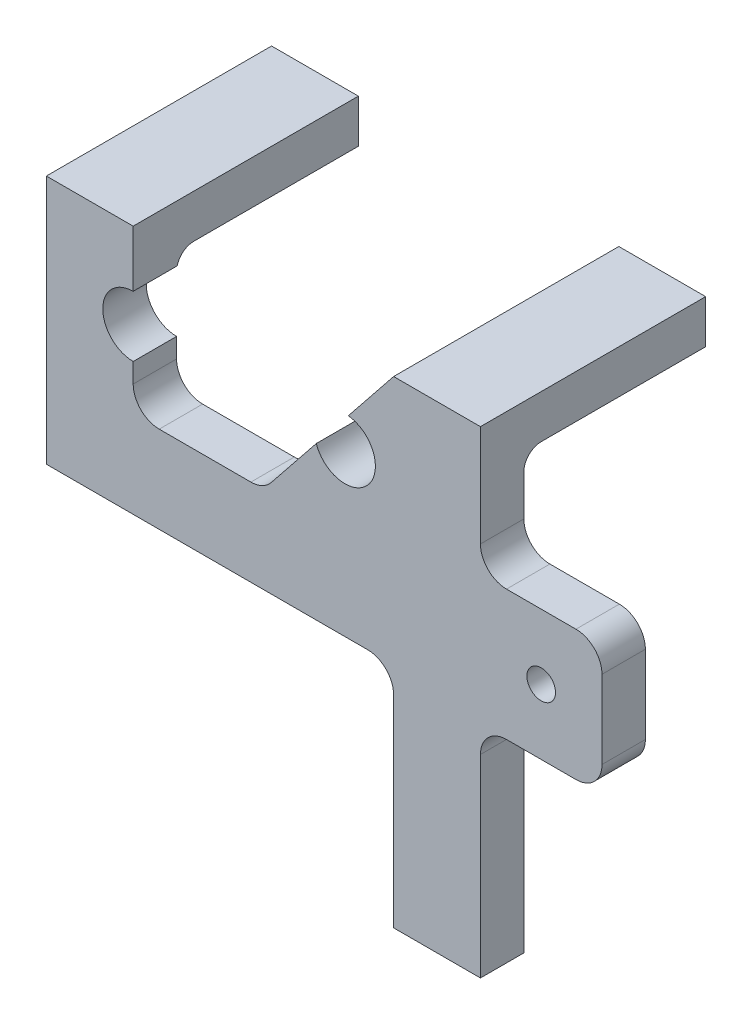
ISO-10303-21;
HEADER;
FILE_DESCRIPTION(('STEP AP214'),'2;1');
FILE_NAME('part.step','',(''),(''),'','','');
FILE_SCHEMA(('AUTOMOTIVE_DESIGN { 1 0 10303 214 1 1 1 1 }'));
ENDSEC;
DATA;
#1=APPLICATION_CONTEXT('core data for automotive mechanical design processes');
#2=APPLICATION_PROTOCOL_DEFINITION('international standard','automotive_design',2000,#1);
#3=PRODUCT_CONTEXT('',#1,'mechanical');
#4=PRODUCT('Part','Part','',(#3));
#5=PRODUCT_RELATED_PRODUCT_CATEGORY('part','',(#4));
#6=PRODUCT_DEFINITION_FORMATION('','',#4);
#7=PRODUCT_DEFINITION_CONTEXT('part definition',#1,'design');
#8=PRODUCT_DEFINITION('design','',#6,#7);
#9=PRODUCT_DEFINITION_SHAPE('','',#8);
#10=(LENGTH_UNIT() NAMED_UNIT(*) SI_UNIT(.MILLI.,.METRE.));
#11=(NAMED_UNIT(*) PLANE_ANGLE_UNIT() SI_UNIT($,.RADIAN.));
#12=(NAMED_UNIT(*) SI_UNIT($,.STERADIAN.) SOLID_ANGLE_UNIT());
#13=UNCERTAINTY_MEASURE_WITH_UNIT(LENGTH_MEASURE(1.E-05),#10,'distance_accuracy_value','');
#14=(GEOMETRIC_REPRESENTATION_CONTEXT(3) GLOBAL_UNCERTAINTY_ASSIGNED_CONTEXT((#13)) GLOBAL_UNIT_ASSIGNED_CONTEXT((#10,
#11,#12)) REPRESENTATION_CONTEXT('',''));
#15=CARTESIAN_POINT('',(0.,0.,0.));
#16=DIRECTION('',(0.,0.,1.));
#17=DIRECTION('',(1.,0.,0.));
#18=AXIS2_PLACEMENT_3D('',#15,#16,#17);
#19=CARTESIAN_POINT('',(0.,0.,6.35));
#20=DIRECTION('',(-1.,0.,0.));
#21=DIRECTION('',(0.,0.,1.));
#22=AXIS2_PLACEMENT_3D('',#19,#20,#21);
#23=PLANE('',#22);
#24=DIRECTION('',(0.,1.,0.));
#25=VECTOR('',#24,1.);
#26=CARTESIAN_POINT('',(0.,0.,6.35));
#27=LINE('',#26,#25);
#28=CARTESIAN_POINT('',(0.,54.98592,6.35));
#29=VERTEX_POINT('',#28);
#30=CARTESIAN_POINT('',(0.,69.85,6.35));
#31=VERTEX_POINT('',#30);
#32=EDGE_CURVE('E316',#29,#31,#27,.T.);
#33=ORIENTED_EDGE('',*,*,#32,.F.);
#34=DIRECTION('',(0.,0.,1.));
#35=VECTOR('',#34,1.);
#36=CARTESIAN_POINT('',(0.,54.98592,6.35));
#37=LINE('',#36,#35);
#38=CARTESIAN_POINT('',(0.,54.98592,0.));
#39=VERTEX_POINT('',#38);
#40=EDGE_CURVE('E576',#29,#39,#37,.F.);
#41=ORIENTED_EDGE('',*,*,#40,.T.);
#42=DIRECTION('',(0.,1.,0.));
#43=VECTOR('',#42,1.);
#44=CARTESIAN_POINT('',(0.,0.,0.));
#45=LINE('',#44,#43);
#46=CARTESIAN_POINT('',(0.,60.96,0.));
#47=VERTEX_POINT('',#46);
#48=EDGE_CURVE('E365',#39,#47,#45,.T.);
#49=ORIENTED_EDGE('',*,*,#48,.T.);
#50=CARTESIAN_POINT('',(0.,60.96,-2.54));
#51=DIRECTION('',(-1.,0.,0.));
#52=DIRECTION('',(0.,0.,1.));
#53=AXIS2_PLACEMENT_3D('',#50,#51,#52);
#54=CIRCLE('',#53,2.54);
#55=CARTESIAN_POINT('',(0.,63.5,-2.54));
#56=VERTEX_POINT('',#55);
#57=EDGE_CURVE('E756',#47,#56,#54,.T.);
#58=ORIENTED_EDGE('',*,*,#57,.T.);
#59=DIRECTION('',(0.,0.,1.));
#60=VECTOR('',#59,1.);
#61=CARTESIAN_POINT('',(0.,63.5,-26.5938));
#62=LINE('',#61,#60);
#63=CARTESIAN_POINT('',(0.,63.5,-26.5938));
#64=VERTEX_POINT('',#63);
#65=EDGE_CURVE('E307',#64,#56,#62,.T.);
#66=ORIENTED_EDGE('',*,*,#65,.F.);
#67=DIRECTION('',(0.,-1.,0.));
#68=VECTOR('',#67,1.);
#69=CARTESIAN_POINT('',(0.,69.85,-26.5938));
#70=LINE('',#69,#68);
#71=CARTESIAN_POINT('',(0.,69.85,-26.5938));
#72=VERTEX_POINT('',#71);
#73=EDGE_CURVE('E280',#72,#64,#70,.T.);
#74=ORIENTED_EDGE('',*,*,#73,.F.);
#75=DIRECTION('',(0.,0.,-1.));
#76=VECTOR('',#75,1.);
#77=CARTESIAN_POINT('',(0.,69.85,6.35));
#78=LINE('',#77,#76);
#79=EDGE_CURVE('E431',#31,#72,#78,.T.);
#80=ORIENTED_EDGE('',*,*,#79,.F.);
#81=EDGE_LOOP('',(#33,#41,#49,#58,#66,#74,#80));
#82=FACE_BOUND('',#81,.T.);
#83=ADVANCED_FACE('F39',(#82),#23,.F.);
#84=CARTESIAN_POINT('',(-19.812,57.15,0.));
#85=DIRECTION('',(0.,0.,1.));
#86=DIRECTION('',(1.,0.,0.));
#87=AXIS2_PLACEMENT_3D('',#84,#85,#86);
#88=PLANE('',#87);
#89=DIRECTION('',(0.,-1.,0.));
#90=VECTOR('',#89,1.);
#91=CARTESIAN_POINT('',(17.78,51.17592,0.));
#92=LINE('',#91,#90);
#93=CARTESIAN_POINT('',(17.78,47.36592,0.));
#94=VERTEX_POINT('',#93);
#95=CARTESIAN_POINT('',(17.78,35.93592,0.));
#96=VERTEX_POINT('',#95);
#97=EDGE_CURVE('E641',#94,#96,#92,.T.);
#98=ORIENTED_EDGE('',*,*,#97,.T.);
#99=CARTESIAN_POINT('',(13.97,35.93592,0.));
#100=DIRECTION('',(0.,0.,1.));
#101=DIRECTION('',(1.,0.,0.));
#102=AXIS2_PLACEMENT_3D('',#99,#100,#101);
#103=CIRCLE('',#102,3.81);
#104=CARTESIAN_POINT('',(13.97,32.12592,0.));
#105=VERTEX_POINT('',#104);
#106=EDGE_CURVE('E593',#96,#105,#103,.F.);
#107=ORIENTED_EDGE('',*,*,#106,.T.);
#108=DIRECTION('',(-1.,0.,0.));
#109=VECTOR('',#108,1.);
#110=CARTESIAN_POINT('',(17.78,32.12592,0.));
#111=LINE('',#110,#109);
#112=CARTESIAN_POINT('',(3.81,32.12592,0.));
#113=VERTEX_POINT('',#112);
#114=EDGE_CURVE('E640',#105,#113,#111,.T.);
#115=ORIENTED_EDGE('',*,*,#114,.T.);
#116=CARTESIAN_POINT('',(3.81,28.31592,0.));
#117=DIRECTION('',(0.,0.,1.));
#118=DIRECTION('',(1.,0.,0.));
#119=AXIS2_PLACEMENT_3D('',#116,#117,#118);
#120=CIRCLE('',#119,3.81);
#121=CARTESIAN_POINT('',(0.,28.31592,0.));
#122=VERTEX_POINT('',#121);
#123=EDGE_CURVE('E552',#113,#122,#120,.T.);
#124=ORIENTED_EDGE('',*,*,#123,.T.);
#125=CARTESIAN_POINT('',(0.,0.,0.));
#126=VERTEX_POINT('',#125);
#127=EDGE_CURVE('E366',#126,#122,#45,.T.);
#128=ORIENTED_EDGE('',*,*,#127,.F.);
#129=DIRECTION('',(1.,0.,0.));
#130=VECTOR('',#129,1.);
#131=CARTESIAN_POINT('',(-12.7,0.,0.));
#132=LINE('',#131,#130);
#133=CARTESIAN_POINT('',(-12.7,0.,0.));
#134=VERTEX_POINT('',#133);
#135=EDGE_CURVE('E311',#134,#126,#132,.T.);
#136=ORIENTED_EDGE('',*,*,#135,.F.);
#137=DIRECTION('',(0.,-1.,0.));
#138=VECTOR('',#137,1.);
#139=CARTESIAN_POINT('',(-12.7,33.3375,0.));
#140=LINE('',#139,#138);
#141=CARTESIAN_POINT('',(-12.7,29.5275,0.));
#142=VERTEX_POINT('',#141);
#143=EDGE_CURVE('E317',#142,#134,#140,.T.);
#144=ORIENTED_EDGE('',*,*,#143,.F.);
#145=CARTESIAN_POINT('',(-16.51,29.5275,0.));
#146=DIRECTION('',(0.,0.,1.));
#147=DIRECTION('',(1.,0.,0.));
#148=AXIS2_PLACEMENT_3D('',#145,#146,#147);
#149=CIRCLE('',#148,3.81);
#150=CARTESIAN_POINT('',(-16.51,33.3375,0.));
#151=VERTEX_POINT('',#150);
#152=EDGE_CURVE('E608',#142,#151,#149,.T.);
#153=ORIENTED_EDGE('',*,*,#152,.T.);
#154=DIRECTION('',(1.,0.,0.));
#155=VECTOR('',#154,1.);
#156=CARTESIAN_POINT('',(-63.5,33.3375,0.));
#157=LINE('',#156,#155);
#158=CARTESIAN_POINT('',(-63.5,33.3375,0.));
#159=VERTEX_POINT('',#158);
#160=EDGE_CURVE('E394',#159,#151,#157,.T.);
#161=ORIENTED_EDGE('',*,*,#160,.F.);
#162=DIRECTION('',(0.,-1.,0.));
#163=VECTOR('',#162,1.);
#164=CARTESIAN_POINT('',(-63.5,69.85,0.));
#165=LINE('',#164,#163);
#166=CARTESIAN_POINT('',(-63.5,60.96,0.));
#167=VERTEX_POINT('',#166);
#168=EDGE_CURVE('E391',#167,#159,#165,.T.);
#169=ORIENTED_EDGE('',*,*,#168,.F.);
#170=DIRECTION('',(-1.,0.,0.));
#171=VECTOR('',#170,1.);
#172=CARTESIAN_POINT('',(-50.8,60.96,0.));
#173=LINE('',#172,#171);
#174=CARTESIAN_POINT('',(-53.0895250599196,60.96,0.));
#175=VERTEX_POINT('',#174);
#176=EDGE_CURVE('E448',#167,#175,#173,.F.);
#177=ORIENTED_EDGE('',*,*,#176,.T.);
#178=CARTESIAN_POINT('',(-50.8,57.15,0.));
#179=DIRECTION('',(0.,0.,-1.));
#180=DIRECTION('',(1.,0.,0.));
#181=AXIS2_PLACEMENT_3D('',#178,#179,#180);
#182=CIRCLE('',#181,4.445);
#183=CARTESIAN_POINT('',(-50.8,52.705,0.));
#184=VERTEX_POINT('',#183);
#185=EDGE_CURVE('E387',#184,#175,#182,.T.);
#186=ORIENTED_EDGE('',*,*,#185,.F.);
#187=DIRECTION('',(0.,1.,0.));
#188=VECTOR('',#187,1.);
#189=CARTESIAN_POINT('',(-50.8,52.705,0.));
#190=LINE('',#189,#188);
#191=CARTESIAN_POINT('',(-50.8,49.8475,0.));
#192=VERTEX_POINT('',#191);
#193=EDGE_CURVE('E384',#192,#184,#190,.T.);
#194=ORIENTED_EDGE('',*,*,#193,.F.);
#195=CARTESIAN_POINT('',(-46.99,49.8475,0.));
#196=DIRECTION('',(0.,0.,1.));
#197=DIRECTION('',(1.,0.,0.));
#198=AXIS2_PLACEMENT_3D('',#195,#196,#197);
#199=CIRCLE('',#198,3.81);
#200=CARTESIAN_POINT('',(-46.99,46.0375,0.));
#201=VERTEX_POINT('',#200);
#202=EDGE_CURVE('E596',#192,#201,#199,.T.);
#203=ORIENTED_EDGE('',*,*,#202,.T.);
#204=DIRECTION('',(-1.,0.,0.));
#205=VECTOR('',#204,1.);
#206=CARTESIAN_POINT('',(-50.8,46.0375,0.));
#207=LINE('',#206,#205);
#208=CARTESIAN_POINT('',(-33.5811806689238,46.0375,0.));
#209=VERTEX_POINT('',#208);
#210=EDGE_CURVE('E380',#209,#201,#207,.T.);
#211=ORIENTED_EDGE('',*,*,#210,.F.);
#212=CARTESIAN_POINT('',(-33.5811806689238,49.8475,0.));
#213=DIRECTION('',(0.,0.,1.));
#214=DIRECTION('',(1.,0.,0.));
#215=AXIS2_PLACEMENT_3D('',#212,#213,#214);
#216=CIRCLE('',#215,3.81);
#217=CARTESIAN_POINT('',(-30.6060705049459,47.4674118688176,0.));
#218=VERTEX_POINT('',#217);
#219=EDGE_CURVE('E602',#209,#218,#216,.T.);
#220=ORIENTED_EDGE('',*,*,#219,.T.);
#221=DIRECTION('',(-0.624695047554424,-0.78086880944303,0.));
#222=VECTOR('',#221,1.);
#223=CARTESIAN_POINT('',(-24.0156991612731,55.7053760484086,0.));
#224=LINE('',#223,#222);
#225=CARTESIAN_POINT('',(-24.0156991612731,55.7053760484086,0.));
#226=VERTEX_POINT('',#225);
#227=EDGE_CURVE('E376',#226,#218,#224,.T.);
#228=ORIENTED_EDGE('',*,*,#227,.F.);
#229=CARTESIAN_POINT('',(-19.812,57.15,0.));
#230=DIRECTION('',(0.,0.,-1.));
#231=DIRECTION('',(1.,0.,0.));
#232=AXIS2_PLACEMENT_3D('',#229,#230,#231);
#233=CIRCLE('',#232,4.445);
#234=CARTESIAN_POINT('',(-19.3253740094586,61.5682824881768,0.));
#235=VERTEX_POINT('',#234);
#236=EDGE_CURVE('E373',#235,#226,#233,.T.);
#237=ORIENTED_EDGE('',*,*,#236,.F.);
#238=DIRECTION('',(-0.624695047554424,-0.78086880944303,0.));
#239=VECTOR('',#238,1.);
#240=CARTESIAN_POINT('',(-12.7,69.85,0.));
#241=LINE('',#240,#239);
#242=CARTESIAN_POINT('',(-15.24,66.675,0.));
#243=VERTEX_POINT('',#242);
#244=EDGE_CURVE('E370',#243,#235,#241,.T.);
#245=ORIENTED_EDGE('',*,*,#244,.F.);
#246=DIRECTION('',(0.,1.,0.));
#247=VECTOR('',#246,1.);
#248=CARTESIAN_POINT('',(-15.24,63.5,0.));
#249=LINE('',#248,#247);
#250=CARTESIAN_POINT('',(-15.24,60.96,0.));
#251=VERTEX_POINT('',#250);
#252=EDGE_CURVE('E441',#243,#251,#249,.F.);
#253=ORIENTED_EDGE('',*,*,#252,.T.);
#254=DIRECTION('',(-1.,0.,0.));
#255=VECTOR('',#254,1.);
#256=CARTESIAN_POINT('',(0.,60.96,0.));
#257=LINE('',#256,#255);
#258=EDGE_CURVE('E444',#251,#47,#257,.F.);
#259=ORIENTED_EDGE('',*,*,#258,.T.);
#260=ORIENTED_EDGE('',*,*,#48,.F.);
#261=CARTESIAN_POINT('',(3.81,54.98592,0.));
#262=DIRECTION('',(0.,0.,1.));
#263=DIRECTION('',(1.,0.,0.));
#264=AXIS2_PLACEMENT_3D('',#261,#262,#263);
#265=CIRCLE('',#264,3.81);
#266=CARTESIAN_POINT('',(3.81,51.17592,0.));
#267=VERTEX_POINT('',#266);
#268=EDGE_CURVE('E11',#39,#267,#265,.T.);
#269=ORIENTED_EDGE('',*,*,#268,.T.);
#270=DIRECTION('',(1.,0.,0.));
#271=VECTOR('',#270,1.);
#272=CARTESIAN_POINT('',(0.,51.17592,0.));
#273=LINE('',#272,#271);
#274=CARTESIAN_POINT('',(13.97,51.17592,0.));
#275=VERTEX_POINT('',#274);
#276=EDGE_CURVE('E635',#267,#275,#273,.T.);
#277=ORIENTED_EDGE('',*,*,#276,.T.);
#278=CARTESIAN_POINT('',(13.97,47.36592,0.));
#279=DIRECTION('',(0.,0.,1.));
#280=DIRECTION('',(1.,0.,0.));
#281=AXIS2_PLACEMENT_3D('',#278,#279,#280);
#282=CIRCLE('',#281,3.81);
#283=EDGE_CURVE('E62',#275,#94,#282,.F.);
#284=ORIENTED_EDGE('',*,*,#283,.T.);
#285=EDGE_LOOP('',(#98,#107,#115,#124,#128,#136,#144,#153,#161,#169,#177,#186,#194,#203,#211,
#220,#228,#237,#245,#253,#259,#260,#269,#277,#284));
#286=FACE_BOUND('',#285,.T.);
#287=CARTESIAN_POINT('',(8.89,41.65092,0.));
#288=DIRECTION('',(0.,0.,1.));
#289=DIRECTION('',(1.,0.,0.));
#290=AXIS2_PLACEMENT_3D('',#287,#288,#289);
#291=CIRCLE('',#290,2.0955);
#292=CARTESIAN_POINT('',(10.9855,41.65092,0.));
#293=VERTEX_POINT('',#292);
#294=EDGE_CURVE('E646',#293,#293,#291,.F.);
#295=ORIENTED_EDGE('',*,*,#294,.F.);
#296=EDGE_LOOP('',(#295));
#297=FACE_BOUND('',#296,.T.);
#298=ADVANCED_FACE('F523',(#286,#297),#88,.F.);
#299=CARTESIAN_POINT('',(-12.7,0.,6.35));
#300=DIRECTION('',(0.,1.,0.));
#301=DIRECTION('',(0.,0.,1.));
#302=AXIS2_PLACEMENT_3D('',#299,#300,#301);
#303=PLANE('',#302);
#304=ORIENTED_EDGE('',*,*,#135,.T.);
#305=DIRECTION('',(0.,0.,-1.));
#306=VECTOR('',#305,1.);
#307=CARTESIAN_POINT('',(0.,0.,6.35));
#308=LINE('',#307,#306);
#309=CARTESIAN_POINT('',(0.,0.,6.35));
#310=VERTEX_POINT('',#309);
#311=EDGE_CURVE('E434',#310,#126,#308,.T.);
#312=ORIENTED_EDGE('',*,*,#311,.F.);
#313=DIRECTION('',(1.,0.,0.));
#314=VECTOR('',#313,1.);
#315=CARTESIAN_POINT('',(-12.7,0.,6.35));
#316=LINE('',#315,#314);
#317=CARTESIAN_POINT('',(-12.7,0.,6.35));
#318=VERTEX_POINT('',#317);
#319=EDGE_CURVE('E312',#318,#310,#316,.T.);
#320=ORIENTED_EDGE('',*,*,#319,.F.);
#321=DIRECTION('',(0.,0.,-1.));
#322=VECTOR('',#321,1.);
#323=CARTESIAN_POINT('',(-12.7,0.,6.35));
#324=LINE('',#323,#322);
#325=EDGE_CURVE('E361',#318,#134,#324,.T.);
#326=ORIENTED_EDGE('',*,*,#325,.T.);
#327=EDGE_LOOP('',(#304,#312,#320,#326));
#328=FACE_BOUND('',#327,.T.);
#329=ADVANCED_FACE('F484',(#328),#303,.F.);
#330=ORIENTED_EDGE('',*,*,#127,.T.);
#331=DIRECTION('',(0.,0.,1.));
#332=VECTOR('',#331,1.);
#333=CARTESIAN_POINT('',(0.,28.31592,6.35));
#334=LINE('',#333,#332);
#335=CARTESIAN_POINT('',(0.,28.31592,6.35));
#336=VERTEX_POINT('',#335);
#337=EDGE_CURVE('E547',#122,#336,#334,.T.);
#338=ORIENTED_EDGE('',*,*,#337,.T.);
#339=EDGE_CURVE('E318',#310,#336,#27,.T.);
#340=ORIENTED_EDGE('',*,*,#339,.F.);
#341=ORIENTED_EDGE('',*,*,#311,.T.);
#342=EDGE_LOOP('',(#330,#338,#340,#341));
#343=FACE_BOUND('',#342,.T.);
#344=ADVANCED_FACE('F525',(#343),#23,.F.);
#345=CARTESIAN_POINT('',(0.,69.85,6.35));
#346=DIRECTION('',(0.,-1.,0.));
#347=DIRECTION('',(0.,0.,-1.));
#348=AXIS2_PLACEMENT_3D('',#345,#346,#347);
#349=PLANE('',#348);
#350=ORIENTED_EDGE('',*,*,#79,.T.);
#351=DIRECTION('',(1.,0.,0.));
#352=VECTOR('',#351,1.);
#353=CARTESIAN_POINT('',(0.,69.85,-26.5938));
#354=LINE('',#353,#352);
#355=CARTESIAN_POINT('',(-12.7,69.85,-26.5938));
#356=VERTEX_POINT('',#355);
#357=EDGE_CURVE('E295',#356,#72,#354,.T.);
#358=ORIENTED_EDGE('',*,*,#357,.F.);
#359=DIRECTION('',(0.,0.,1.));
#360=VECTOR('',#359,1.);
#361=CARTESIAN_POINT('',(-12.7,69.85,-26.5938));
#362=LINE('',#361,#360);
#363=CARTESIAN_POINT('',(-12.7,69.85,-2.54));
#364=VERTEX_POINT('',#363);
#365=EDGE_CURVE('E299',#356,#364,#362,.T.);
#366=ORIENTED_EDGE('',*,*,#365,.T.);
#367=DIRECTION('',(0.,0.,-1.));
#368=VECTOR('',#367,1.);
#369=CARTESIAN_POINT('',(-12.7,69.85,6.35));
#370=LINE('',#369,#368);
#371=CARTESIAN_POINT('',(-12.7,69.85,6.35));
#372=VERTEX_POINT('',#371);
#373=EDGE_CURVE('E428',#372,#364,#370,.T.);
#374=ORIENTED_EDGE('',*,*,#373,.F.);
#375=DIRECTION('',(-1.,0.,0.));
#376=VECTOR('',#375,1.);
#377=CARTESIAN_POINT('',(0.,69.85,6.35));
#378=LINE('',#377,#376);
#379=EDGE_CURVE('E322',#31,#372,#378,.T.);
#380=ORIENTED_EDGE('',*,*,#379,.F.);
#381=EDGE_LOOP('',(#350,#358,#366,#374,#380));
#382=FACE_BOUND('',#381,.T.);
#383=ADVANCED_FACE('F535',(#382),#349,.F.);
#384=CARTESIAN_POINT('',(-12.7,69.85,6.35));
#385=DIRECTION('',(0.78086880944303,-0.624695047554424,0.));
#386=DIRECTION('',(0.624695047554424,0.78086880944303,0.));
#387=AXIS2_PLACEMENT_3D('',#384,#385,#386);
#388=PLANE('',#387);
#389=ORIENTED_EDGE('',*,*,#373,.T.);
#390=CARTESIAN_POINT('',(-15.24,66.675,-2.54));
#391=DIRECTION('',(0.78086880944303,-0.624695047554424,0.));
#392=DIRECTION('',(-0.624695047554424,-0.78086880944303,0.));
#393=AXIS2_PLACEMENT_3D('',#390,#391,#392);
#394=ELLIPSE('',#393,4.06598389076986,2.54);
#395=EDGE_CURVE('E676',#364,#243,#394,.T.);
#396=ORIENTED_EDGE('',*,*,#395,.T.);
#397=ORIENTED_EDGE('',*,*,#244,.T.);
#398=DIRECTION('',(0.,0.,-1.));
#399=VECTOR('',#398,1.);
#400=CARTESIAN_POINT('',(-19.3253740094586,61.5682824881768,6.35));
#401=LINE('',#400,#399);
#402=CARTESIAN_POINT('',(-19.3253740094586,61.5682824881768,6.35));
#403=VERTEX_POINT('',#402);
#404=EDGE_CURVE('E424',#403,#235,#401,.T.);
#405=ORIENTED_EDGE('',*,*,#404,.F.);
#406=DIRECTION('',(-0.624695047554424,-0.78086880944303,0.));
#407=VECTOR('',#406,1.);
#408=CARTESIAN_POINT('',(-12.7,69.85,6.35));
#409=LINE('',#408,#407);
#410=EDGE_CURVE('E325',#372,#403,#409,.T.);
#411=ORIENTED_EDGE('',*,*,#410,.F.);
#412=EDGE_LOOP('',(#389,#396,#397,#405,#411));
#413=FACE_BOUND('',#412,.T.);
#414=ADVANCED_FACE('F541',(#413),#388,.F.);
#415=CARTESIAN_POINT('',(-19.812,57.15,6.35));
#416=DIRECTION('',(0.,0.,-1.));
#417=DIRECTION('',(-1.,0.,0.));
#418=AXIS2_PLACEMENT_3D('',#415,#416,#417);
#419=CYLINDRICAL_SURFACE('',#418,4.445);
#420=ORIENTED_EDGE('',*,*,#236,.T.);
#421=DIRECTION('',(0.,0.,-1.));
#422=VECTOR('',#421,1.);
#423=CARTESIAN_POINT('',(-24.0156991612731,55.7053760484086,6.35));
#424=LINE('',#423,#422);
#425=CARTESIAN_POINT('',(-24.0156991612731,55.7053760484086,6.35));
#426=VERTEX_POINT('',#425);
#427=EDGE_CURVE('E420',#426,#226,#424,.T.);
#428=ORIENTED_EDGE('',*,*,#427,.F.);
#429=CARTESIAN_POINT('',(-19.812,57.15,6.35));
#430=DIRECTION('',(0.,0.,-1.));
#431=DIRECTION('',(1.,0.,0.));
#432=AXIS2_PLACEMENT_3D('',#429,#430,#431);
#433=CIRCLE('',#432,4.445);
#434=EDGE_CURVE('E328',#403,#426,#433,.T.);
#435=ORIENTED_EDGE('',*,*,#434,.F.);
#436=ORIENTED_EDGE('',*,*,#404,.T.);
#437=EDGE_LOOP('',(#420,#428,#435,#436));
#438=FACE_BOUND('',#437,.T.);
#439=ADVANCED_FACE('F738',(#438),#419,.F.);
#440=CARTESIAN_POINT('',(-24.0156991612731,55.7053760484086,6.35));
#441=DIRECTION('',(0.78086880944303,-0.624695047554424,0.));
#442=DIRECTION('',(0.624695047554424,0.78086880944303,0.));
#443=AXIS2_PLACEMENT_3D('',#440,#441,#442);
#444=PLANE('',#443);
#445=ORIENTED_EDGE('',*,*,#227,.T.);
#446=DIRECTION('',(0.,0.,-1.));
#447=VECTOR('',#446,1.);
#448=CARTESIAN_POINT('',(-30.6060705049459,47.4674118688176,6.35));
#449=LINE('',#448,#447);
#450=CARTESIAN_POINT('',(-30.6060705049459,47.4674118688176,6.35));
#451=VERTEX_POINT('',#450);
#452=EDGE_CURVE('E688',#218,#451,#449,.F.);
#453=ORIENTED_EDGE('',*,*,#452,.T.);
#454=DIRECTION('',(-0.624695047554424,-0.78086880944303,0.));
#455=VECTOR('',#454,1.);
#456=CARTESIAN_POINT('',(-24.0156991612731,55.7053760484086,6.35));
#457=LINE('',#456,#455);
#458=EDGE_CURVE('E331',#426,#451,#457,.T.);
#459=ORIENTED_EDGE('',*,*,#458,.F.);
#460=ORIENTED_EDGE('',*,*,#427,.T.);
#461=EDGE_LOOP('',(#445,#453,#459,#460));
#462=FACE_BOUND('',#461,.T.);
#463=ADVANCED_FACE('F734',(#462),#444,.F.);
#464=CARTESIAN_POINT('',(-50.8,46.0375,6.35));
#465=DIRECTION('',(0.,-1.,0.));
#466=DIRECTION('',(0.,0.,-1.));
#467=AXIS2_PLACEMENT_3D('',#464,#465,#466);
#468=PLANE('',#467);
#469=ORIENTED_EDGE('',*,*,#210,.T.);
#470=DIRECTION('',(0.,0.,-1.));
#471=VECTOR('',#470,1.);
#472=CARTESIAN_POINT('',(-46.99,46.0375,6.35));
#473=LINE('',#472,#471);
#474=CARTESIAN_POINT('',(-46.99,46.0375,6.35));
#475=VERTEX_POINT('',#474);
#476=EDGE_CURVE('E685',#201,#475,#473,.F.);
#477=ORIENTED_EDGE('',*,*,#476,.T.);
#478=DIRECTION('',(-1.,0.,0.));
#479=VECTOR('',#478,1.);
#480=CARTESIAN_POINT('',(-50.8,46.0375,6.35));
#481=LINE('',#480,#479);
#482=CARTESIAN_POINT('',(-33.5811806689238,46.0375,6.35));
#483=VERTEX_POINT('',#482);
#484=EDGE_CURVE('E335',#483,#475,#481,.T.);
#485=ORIENTED_EDGE('',*,*,#484,.F.);
#486=DIRECTION('',(0.,0.,-1.));
#487=VECTOR('',#486,1.);
#488=CARTESIAN_POINT('',(-33.5811806689238,46.0375,0.));
#489=LINE('',#488,#487);
#490=EDGE_CURVE('E681',#483,#209,#489,.T.);
#491=ORIENTED_EDGE('',*,*,#490,.T.);
#492=EDGE_LOOP('',(#469,#477,#485,#491));
#493=FACE_BOUND('',#492,.T.);
#494=ADVANCED_FACE('F726',(#493),#468,.F.);
#495=CARTESIAN_POINT('',(-50.8,52.705,6.35));
#496=DIRECTION('',(-1.,0.,0.));
#497=DIRECTION('',(0.,0.,1.));
#498=AXIS2_PLACEMENT_3D('',#495,#496,#497);
#499=PLANE('',#498);
#500=DIRECTION('',(0.,1.,0.));
#501=VECTOR('',#500,1.);
#502=CARTESIAN_POINT('',(-50.8,52.705,6.35));
#503=LINE('',#502,#501);
#504=CARTESIAN_POINT('',(-50.8,49.8475,6.35));
#505=VERTEX_POINT('',#504);
#506=CARTESIAN_POINT('',(-50.8,52.705,6.35));
#507=VERTEX_POINT('',#506);
#508=EDGE_CURVE('E339',#505,#507,#503,.T.);
#509=ORIENTED_EDGE('',*,*,#508,.F.);
#510=DIRECTION('',(0.,0.,-1.));
#511=VECTOR('',#510,1.);
#512=CARTESIAN_POINT('',(-50.8,49.8475,0.));
#513=LINE('',#512,#511);
#514=EDGE_CURVE('E677',#505,#192,#513,.T.);
#515=ORIENTED_EDGE('',*,*,#514,.T.);
#516=ORIENTED_EDGE('',*,*,#193,.T.);
#517=DIRECTION('',(0.,0.,-1.));
#518=VECTOR('',#517,1.);
#519=CARTESIAN_POINT('',(-50.8,52.705,6.35));
#520=LINE('',#519,#518);
#521=EDGE_CURVE('E416',#507,#184,#520,.T.);
#522=ORIENTED_EDGE('',*,*,#521,.F.);
#523=EDGE_LOOP('',(#509,#515,#516,#522));
#524=FACE_BOUND('',#523,.T.);
#525=ADVANCED_FACE('F720',(#524),#499,.F.);
#526=CARTESIAN_POINT('',(-50.8,57.15,6.35));
#527=DIRECTION('',(0.,0.,-1.));
#528=DIRECTION('',(-1.,0.,0.));
#529=AXIS2_PLACEMENT_3D('',#526,#527,#528);
#530=CYLINDRICAL_SURFACE('',#529,4.445);
#531=ORIENTED_EDGE('',*,*,#185,.T.);
#532=CARTESIAN_POINT('',(-53.0895250599196,60.96,0.));
#533=CARTESIAN_POINT('',(-52.9965233707407,61.0158963220729,-2.2966462133705E-05));
#534=CARTESIAN_POINT('',(-52.9014950034798,61.0683572208066,-0.00184531158244023));
#535=CARTESIAN_POINT('',(-52.7079419780591,61.1661569484623,-0.00790017531887777));
#536=CARTESIAN_POINT('',(-52.6094182530155,61.2114976609003,-0.0121320551615551));
#537=CARTESIAN_POINT('',(-52.4113138951135,61.2940306993063,-0.0217251117489694));
#538=CARTESIAN_POINT('',(-52.3117904479379,61.3313635163102,-0.0270628932624042));
#539=CARTESIAN_POINT('',(-52.1103352155206,61.3988029553448,-0.0379565195917531));
#540=CARTESIAN_POINT('',(-52.0084034872875,61.4289097482418,-0.0435123592478581));
#541=CARTESIAN_POINT('',(-51.8161555049799,61.478275158496,-0.0533281162844189));
#542=CARTESIAN_POINT('',(-51.7260744776288,61.4984397030437,-0.0576623741206688));
#543=CARTESIAN_POINT('',(-51.5448024525882,61.5331277555642,-0.0654416428762133));
#544=CARTESIAN_POINT('',(-51.4536115851522,61.5476519190457,-0.0688867571135647));
#545=CARTESIAN_POINT('',(-51.2689072823645,61.5711945891794,-0.07459955494731));
#546=CARTESIAN_POINT('',(-51.1753807090689,61.5801153674318,-0.0768462406642677));
#547=CARTESIAN_POINT('',(-50.9879039682569,61.592021375148,-0.0798872040256234));
#548=CARTESIAN_POINT('',(-50.8939537001074,61.595005111022,-0.0806811161897842));
#549=CARTESIAN_POINT('',(-50.8,61.595,-0.0806555751582846));
#550=B_SPLINE_CURVE_WITH_KNOTS('',3,(#532,#533,#534,#535,#536,#537,#538,#539,#540,#541,#542,
#543,#544,#545,#546,#547,#548,#549),.UNSPECIFIED.,.F.,.F.,(4,2,2,2,2,2,2,2,4),(0.,
0.325388479572874,0.650690738013328,0.969708757315323,1.288719232387,1.56577914446501,
1.84280684780547,2.12454100910697,2.40634603769486),.UNSPECIFIED.);
#551=CARTESIAN_POINT('',(-50.8,61.595,-0.0806555751582845));
#552=VERTEX_POINT('',#551);
#553=EDGE_CURVE('E462',#175,#552,#550,.T.);
#554=ORIENTED_EDGE('',*,*,#553,.T.);
#555=DIRECTION('',(0.,0.,-1.));
#556=VECTOR('',#555,1.);
#557=CARTESIAN_POINT('',(-50.8,61.595,6.35));
#558=LINE('',#557,#556);
#559=CARTESIAN_POINT('',(-50.8,61.595,6.35));
#560=VERTEX_POINT('',#559);
#561=EDGE_CURVE('E413',#560,#552,#558,.T.);
#562=ORIENTED_EDGE('',*,*,#561,.F.);
#563=CARTESIAN_POINT('',(-50.8,57.15,6.35));
#564=DIRECTION('',(0.,0.,-1.));
#565=DIRECTION('',(1.,0.,0.));
#566=AXIS2_PLACEMENT_3D('',#563,#564,#565);
#567=CIRCLE('',#566,4.445);
#568=EDGE_CURVE('E342',#507,#560,#567,.T.);
#569=ORIENTED_EDGE('',*,*,#568,.F.);
#570=ORIENTED_EDGE('',*,*,#521,.T.);
#571=EDGE_LOOP('',(#531,#554,#562,#569,#570));
#572=FACE_BOUND('',#571,.T.);
#573=ADVANCED_FACE('F473',(#572),#530,.F.);
#574=CARTESIAN_POINT('',(-50.8,69.85,6.35));
#575=DIRECTION('',(-1.,0.,0.));
#576=DIRECTION('',(0.,0.,1.));
#577=AXIS2_PLACEMENT_3D('',#574,#575,#576);
#578=PLANE('',#577);
#579=DIRECTION('',(0.,0.,-1.));
#580=VECTOR('',#579,1.);
#581=CARTESIAN_POINT('',(-50.8,69.85,6.35));
#582=LINE('',#581,#580);
#583=CARTESIAN_POINT('',(-50.8,69.85,6.35));
#584=VERTEX_POINT('',#583);
#585=CARTESIAN_POINT('',(-50.8,69.85,-26.5938));
#586=VERTEX_POINT('',#585);
#587=EDGE_CURVE('E410',#584,#586,#582,.T.);
#588=ORIENTED_EDGE('',*,*,#587,.F.);
#589=DIRECTION('',(0.,1.,0.));
#590=VECTOR('',#589,1.);
#591=CARTESIAN_POINT('',(-50.8,69.85,6.35));
#592=LINE('',#591,#590);
#593=EDGE_CURVE('E345',#560,#584,#592,.T.);
#594=ORIENTED_EDGE('',*,*,#593,.F.);
#595=ORIENTED_EDGE('',*,*,#561,.T.);
#596=CARTESIAN_POINT('',(-50.8,60.96,-2.54));
#597=DIRECTION('',(-1.,0.,0.));
#598=DIRECTION('',(0.,0.,1.));
#599=AXIS2_PLACEMENT_3D('',#596,#597,#598);
#600=CIRCLE('',#599,2.54);
#601=CARTESIAN_POINT('',(-50.8,63.5,-2.54));
#602=VERTEX_POINT('',#601);
#603=EDGE_CURVE('E278',#552,#602,#600,.T.);
#604=ORIENTED_EDGE('',*,*,#603,.T.);
#605=DIRECTION('',(0.,0.,1.));
#606=VECTOR('',#605,1.);
#607=CARTESIAN_POINT('',(-50.8,63.5,-26.5938));
#608=LINE('',#607,#606);
#609=CARTESIAN_POINT('',(-50.8,63.5,-26.5938));
#610=VERTEX_POINT('',#609);
#611=EDGE_CURVE('E255',#610,#602,#608,.T.);
#612=ORIENTED_EDGE('',*,*,#611,.F.);
#613=DIRECTION('',(0.,-1.,0.));
#614=VECTOR('',#613,1.);
#615=CARTESIAN_POINT('',(-50.8,69.85,-26.5938));
#616=LINE('',#615,#614);
#617=EDGE_CURVE('E264',#586,#610,#616,.T.);
#618=ORIENTED_EDGE('',*,*,#617,.F.);
#619=EDGE_LOOP('',(#588,#594,#595,#604,#612,#618));
#620=FACE_BOUND('',#619,.T.);
#621=ADVANCED_FACE('F276',(#620),#578,.F.);
#622=CARTESIAN_POINT('',(-50.8,69.85,6.35));
#623=DIRECTION('',(0.,-1.,0.));
#624=DIRECTION('',(1.,0.,0.));
#625=AXIS2_PLACEMENT_3D('',#622,#623,#624);
#626=PLANE('',#625);
#627=ORIENTED_EDGE('',*,*,#587,.T.);
#628=DIRECTION('',(1.,0.,0.));
#629=VECTOR('',#628,1.);
#630=CARTESIAN_POINT('',(-50.8,69.85,-26.5938));
#631=LINE('',#630,#629);
#632=CARTESIAN_POINT('',(-63.5,69.85,-26.5938));
#633=VERTEX_POINT('',#632);
#634=EDGE_CURVE('E270',#633,#586,#631,.T.);
#635=ORIENTED_EDGE('',*,*,#634,.F.);
#636=DIRECTION('',(0.,0.,-1.));
#637=VECTOR('',#636,1.);
#638=CARTESIAN_POINT('',(-63.5,69.85,6.35));
#639=LINE('',#638,#637);
#640=CARTESIAN_POINT('',(-63.5,69.85,6.35));
#641=VERTEX_POINT('',#640);
#642=EDGE_CURVE('E407',#641,#633,#639,.T.);
#643=ORIENTED_EDGE('',*,*,#642,.F.);
#644=DIRECTION('',(-1.,0.,0.));
#645=VECTOR('',#644,1.);
#646=CARTESIAN_POINT('',(-50.8,69.85,6.35));
#647=LINE('',#646,#645);
#648=EDGE_CURVE('E348',#584,#641,#647,.T.);
#649=ORIENTED_EDGE('',*,*,#648,.F.);
#650=EDGE_LOOP('',(#627,#635,#643,#649));
#651=FACE_BOUND('',#650,.T.);
#652=ADVANCED_FACE('F780',(#651),#626,.F.);
#653=CARTESIAN_POINT('',(-63.5,69.85,6.35));
#654=DIRECTION('',(1.,0.,0.));
#655=DIRECTION('',(0.,0.,-1.));
#656=AXIS2_PLACEMENT_3D('',#653,#654,#655);
#657=PLANE('',#656);
#658=ORIENTED_EDGE('',*,*,#642,.T.);
#659=DIRECTION('',(0.,1.,0.));
#660=VECTOR('',#659,1.);
#661=CARTESIAN_POINT('',(-63.5,69.85,-26.5938));
#662=LINE('',#661,#660);
#663=CARTESIAN_POINT('',(-63.5,63.5,-26.5938));
#664=VERTEX_POINT('',#663);
#665=EDGE_CURVE('E263',#664,#633,#662,.T.);
#666=ORIENTED_EDGE('',*,*,#665,.F.);
#667=DIRECTION('',(0.,0.,1.));
#668=VECTOR('',#667,1.);
#669=CARTESIAN_POINT('',(-63.5,63.5,-26.5938));
#670=LINE('',#669,#668);
#671=CARTESIAN_POINT('',(-63.5,63.5,-2.54));
#672=VERTEX_POINT('',#671);
#673=EDGE_CURVE('E258',#664,#672,#670,.T.);
#674=ORIENTED_EDGE('',*,*,#673,.T.);
#675=CARTESIAN_POINT('',(-63.5,60.96,-2.54));
#676=DIRECTION('',(1.,0.,0.));
#677=DIRECTION('',(0.,0.,-1.));
#678=AXIS2_PLACEMENT_3D('',#675,#676,#677);
#679=CIRCLE('',#678,2.54);
#680=EDGE_CURVE('E459',#672,#167,#679,.T.);
#681=ORIENTED_EDGE('',*,*,#680,.T.);
#682=ORIENTED_EDGE('',*,*,#168,.T.);
#683=DIRECTION('',(0.,0.,-1.));
#684=VECTOR('',#683,1.);
#685=CARTESIAN_POINT('',(-63.5,33.3375,6.35));
#686=LINE('',#685,#684);
#687=CARTESIAN_POINT('',(-63.5,33.3375,6.35));
#688=VERTEX_POINT('',#687);
#689=EDGE_CURVE('E403',#688,#159,#686,.T.);
#690=ORIENTED_EDGE('',*,*,#689,.F.);
#691=DIRECTION('',(0.,-1.,0.));
#692=VECTOR('',#691,1.);
#693=CARTESIAN_POINT('',(-63.5,69.85,6.35));
#694=LINE('',#693,#692);
#695=EDGE_CURVE('E351',#641,#688,#694,.T.);
#696=ORIENTED_EDGE('',*,*,#695,.F.);
#697=EDGE_LOOP('',(#658,#666,#674,#681,#682,#690,#696));
#698=FACE_BOUND('',#697,.T.);
#699=ADVANCED_FACE('F784',(#698),#657,.F.);
#700=CARTESIAN_POINT('',(-63.5,33.3375,6.35));
#701=DIRECTION('',(0.,1.,0.));
#702=DIRECTION('',(0.,0.,1.));
#703=AXIS2_PLACEMENT_3D('',#700,#701,#702);
#704=PLANE('',#703);
#705=ORIENTED_EDGE('',*,*,#160,.T.);
#706=DIRECTION('',(0.,0.,-1.));
#707=VECTOR('',#706,1.);
#708=CARTESIAN_POINT('',(-16.51,33.3375,6.35));
#709=LINE('',#708,#707);
#710=CARTESIAN_POINT('',(-16.51,33.3375,6.35));
#711=VERTEX_POINT('',#710);
#712=EDGE_CURVE('E556',#151,#711,#709,.F.);
#713=ORIENTED_EDGE('',*,*,#712,.T.);
#714=DIRECTION('',(1.,0.,0.));
#715=VECTOR('',#714,1.);
#716=CARTESIAN_POINT('',(-63.5,33.3375,6.35));
#717=LINE('',#716,#715);
#718=EDGE_CURVE('E354',#688,#711,#717,.T.);
#719=ORIENTED_EDGE('',*,*,#718,.F.);
#720=ORIENTED_EDGE('',*,*,#689,.T.);
#721=EDGE_LOOP('',(#705,#713,#719,#720));
#722=FACE_BOUND('',#721,.T.);
#723=ADVANCED_FACE('F704',(#722),#704,.F.);
#724=CARTESIAN_POINT('',(-12.7,33.3375,6.35));
#725=DIRECTION('',(1.,0.,0.));
#726=DIRECTION('',(0.,1.,0.));
#727=AXIS2_PLACEMENT_3D('',#724,#725,#726);
#728=PLANE('',#727);
#729=DIRECTION('',(0.,-1.,0.));
#730=VECTOR('',#729,1.);
#731=CARTESIAN_POINT('',(-12.7,33.3375,6.35));
#732=LINE('',#731,#730);
#733=CARTESIAN_POINT('',(-12.7,29.5275,6.35));
#734=VERTEX_POINT('',#733);
#735=EDGE_CURVE('E358',#734,#318,#732,.T.);
#736=ORIENTED_EDGE('',*,*,#735,.F.);
#737=DIRECTION('',(0.,0.,-1.));
#738=VECTOR('',#737,1.);
#739=CARTESIAN_POINT('',(-12.7,29.5275,0.));
#740=LINE('',#739,#738);
#741=EDGE_CURVE('E563',#734,#142,#740,.T.);
#742=ORIENTED_EDGE('',*,*,#741,.T.);
#743=ORIENTED_EDGE('',*,*,#143,.T.);
#744=ORIENTED_EDGE('',*,*,#325,.F.);
#745=EDGE_LOOP('',(#736,#742,#743,#744));
#746=FACE_BOUND('',#745,.T.);
#747=ADVANCED_FACE('F696',(#746),#728,.F.);
#748=CARTESIAN_POINT('',(-19.812,57.15,6.35));
#749=DIRECTION('',(0.,0.,1.));
#750=DIRECTION('',(1.,0.,0.));
#751=AXIS2_PLACEMENT_3D('',#748,#749,#750);
#752=PLANE('',#751);
#753=DIRECTION('',(1.,0.,0.));
#754=VECTOR('',#753,1.);
#755=CARTESIAN_POINT('',(17.78,32.12592,6.35));
#756=LINE('',#755,#754);
#757=CARTESIAN_POINT('',(3.81,32.12592,6.35));
#758=VERTEX_POINT('',#757);
#759=CARTESIAN_POINT('',(13.97,32.12592,6.35));
#760=VERTEX_POINT('',#759);
#761=EDGE_CURVE('E654',#758,#760,#756,.T.);
#762=ORIENTED_EDGE('',*,*,#761,.T.);
#763=CARTESIAN_POINT('',(13.97,35.93592,6.35));
#764=DIRECTION('',(0.,0.,1.));
#765=DIRECTION('',(1.,0.,0.));
#766=AXIS2_PLACEMENT_3D('',#763,#764,#765);
#767=CIRCLE('',#766,3.81);
#768=CARTESIAN_POINT('',(17.78,35.93592,6.35));
#769=VERTEX_POINT('',#768);
#770=EDGE_CURVE('E582',#760,#769,#767,.T.);
#771=ORIENTED_EDGE('',*,*,#770,.T.);
#772=DIRECTION('',(0.,1.,0.));
#773=VECTOR('',#772,1.);
#774=CARTESIAN_POINT('',(17.78,51.17592,6.35));
#775=LINE('',#774,#773);
#776=CARTESIAN_POINT('',(17.78,47.36592,6.35));
#777=VERTEX_POINT('',#776);
#778=EDGE_CURVE('E657',#769,#777,#775,.T.);
#779=ORIENTED_EDGE('',*,*,#778,.T.);
#780=CARTESIAN_POINT('',(13.97,47.36592,6.35));
#781=DIRECTION('',(0.,0.,1.));
#782=DIRECTION('',(1.,0.,0.));
#783=AXIS2_PLACEMENT_3D('',#780,#781,#782);
#784=CIRCLE('',#783,3.81);
#785=CARTESIAN_POINT('',(13.97,51.17592,6.35));
#786=VERTEX_POINT('',#785);
#787=EDGE_CURVE('E579',#777,#786,#784,.T.);
#788=ORIENTED_EDGE('',*,*,#787,.T.);
#789=DIRECTION('',(-1.,0.,0.));
#790=VECTOR('',#789,1.);
#791=CARTESIAN_POINT('',(0.,51.17592,6.35));
#792=LINE('',#791,#790);
#793=CARTESIAN_POINT('',(3.81,51.17592,6.35));
#794=VERTEX_POINT('',#793);
#795=EDGE_CURVE('E625',#786,#794,#792,.T.);
#796=ORIENTED_EDGE('',*,*,#795,.T.);
#797=CARTESIAN_POINT('',(3.81,54.98592,6.35));
#798=DIRECTION('',(0.,0.,1.));
#799=DIRECTION('',(1.,0.,0.));
#800=AXIS2_PLACEMENT_3D('',#797,#798,#799);
#801=CIRCLE('',#800,3.81);
#802=EDGE_CURVE('E48',#794,#29,#801,.F.);
#803=ORIENTED_EDGE('',*,*,#802,.T.);
#804=ORIENTED_EDGE('',*,*,#32,.T.);
#805=ORIENTED_EDGE('',*,*,#379,.T.);
#806=ORIENTED_EDGE('',*,*,#410,.T.);
#807=ORIENTED_EDGE('',*,*,#434,.T.);
#808=ORIENTED_EDGE('',*,*,#458,.T.);
#809=CARTESIAN_POINT('',(-33.5811806689238,49.8475,6.35));
#810=DIRECTION('',(0.,0.,1.));
#811=DIRECTION('',(1.,0.,0.));
#812=AXIS2_PLACEMENT_3D('',#809,#810,#811);
#813=CIRCLE('',#812,3.81);
#814=EDGE_CURVE('E605',#451,#483,#813,.F.);
#815=ORIENTED_EDGE('',*,*,#814,.T.);
#816=ORIENTED_EDGE('',*,*,#484,.T.);
#817=CARTESIAN_POINT('',(-46.99,49.8475,6.35));
#818=DIRECTION('',(0.,0.,1.));
#819=DIRECTION('',(1.,0.,0.));
#820=AXIS2_PLACEMENT_3D('',#817,#818,#819);
#821=CIRCLE('',#820,3.81);
#822=EDGE_CURVE('E599',#475,#505,#821,.F.);
#823=ORIENTED_EDGE('',*,*,#822,.T.);
#824=ORIENTED_EDGE('',*,*,#508,.T.);
#825=ORIENTED_EDGE('',*,*,#568,.T.);
#826=ORIENTED_EDGE('',*,*,#593,.T.);
#827=ORIENTED_EDGE('',*,*,#648,.T.);
#828=ORIENTED_EDGE('',*,*,#695,.T.);
#829=ORIENTED_EDGE('',*,*,#718,.T.);
#830=CARTESIAN_POINT('',(-16.51,29.5275,6.35));
#831=DIRECTION('',(0.,0.,1.));
#832=DIRECTION('',(1.,0.,0.));
#833=AXIS2_PLACEMENT_3D('',#830,#831,#832);
#834=CIRCLE('',#833,3.81);
#835=EDGE_CURVE('E611',#711,#734,#834,.F.);
#836=ORIENTED_EDGE('',*,*,#835,.T.);
#837=ORIENTED_EDGE('',*,*,#735,.T.);
#838=ORIENTED_EDGE('',*,*,#319,.T.);
#839=ORIENTED_EDGE('',*,*,#339,.T.);
#840=CARTESIAN_POINT('',(3.81,28.31592,6.35));
#841=DIRECTION('',(0.,0.,1.));
#842=DIRECTION('',(1.,0.,0.));
#843=AXIS2_PLACEMENT_3D('',#840,#841,#842);
#844=CIRCLE('',#843,3.81);
#845=EDGE_CURVE('E553',#336,#758,#844,.F.);
#846=ORIENTED_EDGE('',*,*,#845,.T.);
#847=EDGE_LOOP('',(#762,#771,#779,#788,#796,#803,#804,#805,#806,#807,#808,#815,#816,#823,#824,
#825,#826,#827,#828,#829,#836,#837,#838,#839,#846));
#848=FACE_BOUND('',#847,.T.);
#849=CARTESIAN_POINT('',(8.89,41.65092,6.35));
#850=DIRECTION('',(0.,0.,1.));
#851=DIRECTION('',(1.,0.,0.));
#852=AXIS2_PLACEMENT_3D('',#849,#850,#851);
#853=CIRCLE('',#852,2.0955);
#854=CARTESIAN_POINT('',(10.9855,41.65092,6.35));
#855=VERTEX_POINT('',#854);
#856=EDGE_CURVE('E650',#855,#855,#853,.T.);
#857=ORIENTED_EDGE('',*,*,#856,.F.);
#858=EDGE_LOOP('',(#857));
#859=FACE_BOUND('',#858,.T.);
#860=ADVANCED_FACE('F621',(#848,#859),#752,.T.);
#861=CARTESIAN_POINT('',(0.,63.5,-26.5938));
#862=DIRECTION('',(0.,1.,0.));
#863=DIRECTION('',(0.,0.,1.));
#864=AXIS2_PLACEMENT_3D('',#861,#862,#863);
#865=PLANE('',#864);
#866=ORIENTED_EDGE('',*,*,#65,.T.);
#867=DIRECTION('',(-1.,0.,0.));
#868=VECTOR('',#867,1.);
#869=CARTESIAN_POINT('',(-12.7,63.5,-2.54));
#870=LINE('',#869,#868);
#871=CARTESIAN_POINT('',(-12.7,63.5,-2.54));
#872=VERTEX_POINT('',#871);
#873=EDGE_CURVE('E451',#56,#872,#870,.T.);
#874=ORIENTED_EDGE('',*,*,#873,.T.);
#875=DIRECTION('',(0.,0.,1.));
#876=VECTOR('',#875,1.);
#877=CARTESIAN_POINT('',(-12.7,63.5,-26.5938));
#878=LINE('',#877,#876);
#879=CARTESIAN_POINT('',(-12.7,63.5,-26.5938));
#880=VERTEX_POINT('',#879);
#881=EDGE_CURVE('E303',#880,#872,#878,.T.);
#882=ORIENTED_EDGE('',*,*,#881,.F.);
#883=DIRECTION('',(-1.,0.,0.));
#884=VECTOR('',#883,1.);
#885=CARTESIAN_POINT('',(0.,63.5,-26.5938));
#886=LINE('',#885,#884);
#887=EDGE_CURVE('E285',#64,#880,#886,.T.);
#888=ORIENTED_EDGE('',*,*,#887,.F.);
#889=EDGE_LOOP('',(#866,#874,#882,#888));
#890=FACE_BOUND('',#889,.T.);
#891=ADVANCED_FACE('F748',(#890),#865,.F.);
#892=CARTESIAN_POINT('',(-12.7,69.85,-26.5938));
#893=DIRECTION('',(1.,0.,0.));
#894=DIRECTION('',(0.,1.,0.));
#895=AXIS2_PLACEMENT_3D('',#892,#893,#894);
#896=PLANE('',#895);
#897=ORIENTED_EDGE('',*,*,#881,.T.);
#898=DIRECTION('',(0.,1.,0.));
#899=VECTOR('',#898,1.);
#900=CARTESIAN_POINT('',(-12.7,69.85,-2.54));
#901=LINE('',#900,#899);
#902=EDGE_CURVE('E455',#872,#364,#901,.T.);
#903=ORIENTED_EDGE('',*,*,#902,.T.);
#904=ORIENTED_EDGE('',*,*,#365,.F.);
#905=DIRECTION('',(0.,1.,0.));
#906=VECTOR('',#905,1.);
#907=CARTESIAN_POINT('',(-12.7,69.85,-26.5938));
#908=LINE('',#907,#906);
#909=EDGE_CURVE('E292',#880,#356,#908,.T.);
#910=ORIENTED_EDGE('',*,*,#909,.F.);
#911=EDGE_LOOP('',(#897,#903,#904,#910));
#912=FACE_BOUND('',#911,.T.);
#913=ADVANCED_FACE('F752',(#912),#896,.F.);
#914=CARTESIAN_POINT('',(0.,0.,-26.5938));
#915=DIRECTION('',(0.,0.,-1.));
#916=DIRECTION('',(-1.,0.,0.));
#917=AXIS2_PLACEMENT_3D('',#914,#915,#916);
#918=PLANE('',#917);
#919=ORIENTED_EDGE('',*,*,#73,.T.);
#920=ORIENTED_EDGE('',*,*,#887,.T.);
#921=ORIENTED_EDGE('',*,*,#909,.T.);
#922=ORIENTED_EDGE('',*,*,#357,.T.);
#923=EDGE_LOOP('',(#919,#920,#921,#922));
#924=FACE_BOUND('',#923,.T.);
#925=ADVANCED_FACE('F755',(#924),#918,.T.);
#926=CARTESIAN_POINT('',(-50.8,63.5,-26.5938));
#927=DIRECTION('',(0.,1.,0.));
#928=DIRECTION('',(0.,0.,1.));
#929=AXIS2_PLACEMENT_3D('',#926,#927,#928);
#930=PLANE('',#929);
#931=ORIENTED_EDGE('',*,*,#611,.T.);
#932=DIRECTION('',(-1.,0.,0.));
#933=VECTOR('',#932,1.);
#934=CARTESIAN_POINT('',(-63.5,63.5,-2.54));
#935=LINE('',#934,#933);
#936=EDGE_CURVE('E438',#602,#672,#935,.T.);
#937=ORIENTED_EDGE('',*,*,#936,.T.);
#938=ORIENTED_EDGE('',*,*,#673,.F.);
#939=DIRECTION('',(-1.,0.,0.));
#940=VECTOR('',#939,1.);
#941=CARTESIAN_POINT('',(-50.8,63.5,-26.5938));
#942=LINE('',#941,#940);
#943=EDGE_CURVE('E250',#610,#664,#942,.T.);
#944=ORIENTED_EDGE('',*,*,#943,.F.);
#945=EDGE_LOOP('',(#931,#937,#938,#944));
#946=FACE_BOUND('',#945,.T.);
#947=ADVANCED_FACE('F252',(#946),#930,.F.);
#948=CARTESIAN_POINT('',(0.,0.,-26.5938));
#949=DIRECTION('',(0.,0.,-1.));
#950=DIRECTION('',(-1.,0.,0.));
#951=AXIS2_PLACEMENT_3D('',#948,#949,#950);
#952=PLANE('',#951);
#953=ORIENTED_EDGE('',*,*,#617,.T.);
#954=ORIENTED_EDGE('',*,*,#943,.T.);
#955=ORIENTED_EDGE('',*,*,#665,.T.);
#956=ORIENTED_EDGE('',*,*,#634,.T.);
#957=EDGE_LOOP('',(#953,#954,#955,#956));
#958=FACE_BOUND('',#957,.T.);
#959=ADVANCED_FACE('F268',(#958),#952,.T.);
#960=CARTESIAN_POINT('',(-50.8,60.96,-2.54));
#961=DIRECTION('',(1.,0.,0.));
#962=DIRECTION('',(0.,0.,-1.));
#963=AXIS2_PLACEMENT_3D('',#960,#961,#962);
#964=CYLINDRICAL_SURFACE('',#963,2.54);
#965=ORIENTED_EDGE('',*,*,#553,.F.);
#966=ORIENTED_EDGE('',*,*,#176,.F.);
#967=ORIENTED_EDGE('',*,*,#680,.F.);
#968=ORIENTED_EDGE('',*,*,#936,.F.);
#969=ORIENTED_EDGE('',*,*,#603,.F.);
#970=EDGE_LOOP('',(#965,#966,#967,#968,#969));
#971=FACE_BOUND('',#970,.T.);
#972=ADVANCED_FACE('F477',(#971),#964,.F.);
#973=CARTESIAN_POINT('',(-15.24,69.85,-2.54));
#974=DIRECTION('',(0.,-1.,0.));
#975=DIRECTION('',(1.,0.,0.));
#976=AXIS2_PLACEMENT_3D('',#973,#974,#975);
#977=CYLINDRICAL_SURFACE('',#976,2.54);
#978=ORIENTED_EDGE('',*,*,#395,.F.);
#979=ORIENTED_EDGE('',*,*,#902,.F.);
#980=CARTESIAN_POINT('',(-15.24,60.96,-2.54));
#981=DIRECTION('',(0.707106781186547,-0.707106781186548,0.));
#982=DIRECTION('',(-0.707106781186548,-0.707106781186547,0.));
#983=AXIS2_PLACEMENT_3D('',#980,#981,#982);
#984=ELLIPSE('',#983,3.59210244842766,2.54);
#985=EDGE_CURVE('E274',#251,#872,#984,.F.);
#986=ORIENTED_EDGE('',*,*,#985,.F.);
#987=ORIENTED_EDGE('',*,*,#252,.F.);
#988=EDGE_LOOP('',(#978,#979,#986,#987));
#989=FACE_BOUND('',#988,.T.);
#990=ADVANCED_FACE('F482',(#989),#977,.F.);
#991=CARTESIAN_POINT('',(0.,60.96,-2.54));
#992=DIRECTION('',(1.,0.,0.));
#993=DIRECTION('',(0.,0.,-1.));
#994=AXIS2_PLACEMENT_3D('',#991,#992,#993);
#995=CYLINDRICAL_SURFACE('',#994,2.54);
#996=ORIENTED_EDGE('',*,*,#57,.F.);
#997=ORIENTED_EDGE('',*,*,#258,.F.);
#998=ORIENTED_EDGE('',*,*,#985,.T.);
#999=ORIENTED_EDGE('',*,*,#873,.F.);
#1000=EDGE_LOOP('',(#996,#997,#998,#999));
#1001=FACE_BOUND('',#1000,.T.);
#1002=ADVANCED_FACE('F486',(#1001),#995,.F.);
#1003=CARTESIAN_POINT('',(17.78,32.12592,-26.0582213514277));
#1004=DIRECTION('',(0.,-1.,0.));
#1005=DIRECTION('',(0.,0.,-1.));
#1006=AXIS2_PLACEMENT_3D('',#1003,#1004,#1005);
#1007=PLANE('',#1006);
#1008=ORIENTED_EDGE('',*,*,#761,.F.);
#1009=DIRECTION('',(0.,0.,1.));
#1010=VECTOR('',#1009,1.);
#1011=CARTESIAN_POINT('',(3.81,32.12592,-26.0582213514277));
#1012=LINE('',#1011,#1010);
#1013=EDGE_CURVE('E561',#758,#113,#1012,.F.);
#1014=ORIENTED_EDGE('',*,*,#1013,.T.);
#1015=ORIENTED_EDGE('',*,*,#114,.F.);
#1016=DIRECTION('',(0.,0.,1.));
#1017=VECTOR('',#1016,1.);
#1018=CARTESIAN_POINT('',(13.97,32.12592,-26.0582213514277));
#1019=LINE('',#1018,#1017);
#1020=EDGE_CURVE('E555',#105,#760,#1019,.T.);
#1021=ORIENTED_EDGE('',*,*,#1020,.T.);
#1022=EDGE_LOOP('',(#1008,#1014,#1015,#1021));
#1023=FACE_BOUND('',#1022,.T.);
#1024=ADVANCED_FACE('F489',(#1023),#1007,.T.);
#1025=CARTESIAN_POINT('',(17.78,51.17592,-26.0582213514277));
#1026=DIRECTION('',(1.,0.,0.));
#1027=DIRECTION('',(0.,1.,0.));
#1028=AXIS2_PLACEMENT_3D('',#1025,#1026,#1027);
#1029=PLANE('',#1028);
#1030=ORIENTED_EDGE('',*,*,#778,.F.);
#1031=DIRECTION('',(0.,0.,1.));
#1032=VECTOR('',#1031,1.);
#1033=CARTESIAN_POINT('',(17.78,35.93592,-26.0582213514277));
#1034=LINE('',#1033,#1032);
#1035=EDGE_CURVE('E55',#769,#96,#1034,.F.);
#1036=ORIENTED_EDGE('',*,*,#1035,.T.);
#1037=ORIENTED_EDGE('',*,*,#97,.F.);
#1038=DIRECTION('',(0.,0.,1.));
#1039=VECTOR('',#1038,1.);
#1040=CARTESIAN_POINT('',(17.78,47.36592,-26.0582213514277));
#1041=LINE('',#1040,#1039);
#1042=EDGE_CURVE('E585',#94,#777,#1041,.T.);
#1043=ORIENTED_EDGE('',*,*,#1042,.T.);
#1044=EDGE_LOOP('',(#1030,#1036,#1037,#1043));
#1045=FACE_BOUND('',#1044,.T.);
#1046=ADVANCED_FACE('F807',(#1045),#1029,.T.);
#1047=CARTESIAN_POINT('',(0.,51.17592,-26.0582213514277));
#1048=DIRECTION('',(0.,1.,0.));
#1049=DIRECTION('',(0.,0.,1.));
#1050=AXIS2_PLACEMENT_3D('',#1047,#1048,#1049);
#1051=PLANE('',#1050);
#1052=ORIENTED_EDGE('',*,*,#276,.F.);
#1053=DIRECTION('',(0.,0.,1.));
#1054=VECTOR('',#1053,1.);
#1055=CARTESIAN_POINT('',(3.81,51.17592,-26.0582213514277));
#1056=LINE('',#1055,#1054);
#1057=EDGE_CURVE('E572',#267,#794,#1056,.T.);
#1058=ORIENTED_EDGE('',*,*,#1057,.T.);
#1059=ORIENTED_EDGE('',*,*,#795,.F.);
#1060=DIRECTION('',(0.,0.,1.));
#1061=VECTOR('',#1060,1.);
#1062=CARTESIAN_POINT('',(13.97,51.17592,-26.0582213514277));
#1063=LINE('',#1062,#1061);
#1064=EDGE_CURVE('E569',#786,#275,#1063,.F.);
#1065=ORIENTED_EDGE('',*,*,#1064,.T.);
#1066=EDGE_LOOP('',(#1052,#1058,#1059,#1065));
#1067=FACE_BOUND('',#1066,.T.);
#1068=ADVANCED_FACE('F637',(#1067),#1051,.T.);
#1069=CARTESIAN_POINT('',(8.89,41.65092,-26.0582213514277));
#1070=DIRECTION('',(0.,0.,1.));
#1071=DIRECTION('',(1.,0.,0.));
#1072=AXIS2_PLACEMENT_3D('',#1069,#1070,#1071);
#1073=CYLINDRICAL_SURFACE('',#1072,2.0955);
#1074=ORIENTED_EDGE('',*,*,#294,.T.);
#1075=EDGE_LOOP('',(#1074));
#1076=FACE_BOUND('',#1075,.T.);
#1077=ORIENTED_EDGE('',*,*,#856,.T.);
#1078=EDGE_LOOP('',(#1077));
#1079=FACE_BOUND('',#1078,.T.);
#1080=ADVANCED_FACE('F498',(#1076,#1079),#1073,.F.);
#1081=CARTESIAN_POINT('',(-46.99,49.8475,6.35));
#1082=DIRECTION('',(0.,0.,1.));
#1083=DIRECTION('',(1.,0.,0.));
#1084=AXIS2_PLACEMENT_3D('',#1081,#1082,#1083);
#1085=CYLINDRICAL_SURFACE('',#1084,3.81);
#1086=ORIENTED_EDGE('',*,*,#822,.F.);
#1087=ORIENTED_EDGE('',*,*,#476,.F.);
#1088=ORIENTED_EDGE('',*,*,#202,.F.);
#1089=ORIENTED_EDGE('',*,*,#514,.F.);
#1090=EDGE_LOOP('',(#1086,#1087,#1088,#1089));
#1091=FACE_BOUND('',#1090,.T.);
#1092=ADVANCED_FACE('F494',(#1091),#1085,.F.);
#1093=CARTESIAN_POINT('',(-33.5811806689238,49.8475,6.35));
#1094=DIRECTION('',(0.,0.,1.));
#1095=DIRECTION('',(1.,0.,0.));
#1096=AXIS2_PLACEMENT_3D('',#1093,#1094,#1095);
#1097=CYLINDRICAL_SURFACE('',#1096,3.81);
#1098=ORIENTED_EDGE('',*,*,#814,.F.);
#1099=ORIENTED_EDGE('',*,*,#452,.F.);
#1100=ORIENTED_EDGE('',*,*,#219,.F.);
#1101=ORIENTED_EDGE('',*,*,#490,.F.);
#1102=EDGE_LOOP('',(#1098,#1099,#1100,#1101));
#1103=FACE_BOUND('',#1102,.T.);
#1104=ADVANCED_FACE('F497',(#1103),#1097,.F.);
#1105=CARTESIAN_POINT('',(-16.51,29.5275,6.35));
#1106=DIRECTION('',(0.,0.,1.));
#1107=DIRECTION('',(1.,0.,0.));
#1108=AXIS2_PLACEMENT_3D('',#1105,#1106,#1107);
#1109=CYLINDRICAL_SURFACE('',#1108,3.81);
#1110=ORIENTED_EDGE('',*,*,#835,.F.);
#1111=ORIENTED_EDGE('',*,*,#712,.F.);
#1112=ORIENTED_EDGE('',*,*,#152,.F.);
#1113=ORIENTED_EDGE('',*,*,#741,.F.);
#1114=EDGE_LOOP('',(#1110,#1111,#1112,#1113));
#1115=FACE_BOUND('',#1114,.T.);
#1116=ADVANCED_FACE('F502',(#1115),#1109,.F.);
#1117=CARTESIAN_POINT('',(3.81,28.31592,6.35));
#1118=DIRECTION('',(0.,0.,1.));
#1119=DIRECTION('',(1.,0.,0.));
#1120=AXIS2_PLACEMENT_3D('',#1117,#1118,#1119);
#1121=CYLINDRICAL_SURFACE('',#1120,3.81);
#1122=ORIENTED_EDGE('',*,*,#123,.F.);
#1123=ORIENTED_EDGE('',*,*,#1013,.F.);
#1124=ORIENTED_EDGE('',*,*,#845,.F.);
#1125=ORIENTED_EDGE('',*,*,#337,.F.);
#1126=EDGE_LOOP('',(#1122,#1123,#1124,#1125));
#1127=FACE_BOUND('',#1126,.T.);
#1128=ADVANCED_FACE('F506',(#1127),#1121,.F.);
#1129=CARTESIAN_POINT('',(3.81,54.98592,-26.0582213514277));
#1130=DIRECTION('',(0.,0.,1.));
#1131=DIRECTION('',(1.,0.,0.));
#1132=AXIS2_PLACEMENT_3D('',#1129,#1130,#1131);
#1133=CYLINDRICAL_SURFACE('',#1132,3.81);
#1134=ORIENTED_EDGE('',*,*,#268,.F.);
#1135=ORIENTED_EDGE('',*,*,#40,.F.);
#1136=ORIENTED_EDGE('',*,*,#802,.F.);
#1137=ORIENTED_EDGE('',*,*,#1057,.F.);
#1138=EDGE_LOOP('',(#1134,#1135,#1136,#1137));
#1139=FACE_BOUND('',#1138,.T.);
#1140=ADVANCED_FACE('F510',(#1139),#1133,.F.);
#1141=CARTESIAN_POINT('',(13.97,35.93592,-26.0582213514277));
#1142=DIRECTION('',(0.,0.,1.));
#1143=DIRECTION('',(1.,0.,0.));
#1144=AXIS2_PLACEMENT_3D('',#1141,#1142,#1143);
#1145=CYLINDRICAL_SURFACE('',#1144,3.81);
#1146=ORIENTED_EDGE('',*,*,#106,.F.);
#1147=ORIENTED_EDGE('',*,*,#1035,.F.);
#1148=ORIENTED_EDGE('',*,*,#770,.F.);
#1149=ORIENTED_EDGE('',*,*,#1020,.F.);
#1150=EDGE_LOOP('',(#1146,#1147,#1148,#1149));
#1151=FACE_BOUND('',#1150,.T.);
#1152=ADVANCED_FACE('F513',(#1151),#1145,.T.);
#1153=CARTESIAN_POINT('',(13.97,47.36592,-26.0582213514277));
#1154=DIRECTION('',(0.,0.,1.));
#1155=DIRECTION('',(1.,0.,0.));
#1156=AXIS2_PLACEMENT_3D('',#1153,#1154,#1155);
#1157=CYLINDRICAL_SURFACE('',#1156,3.81);
#1158=ORIENTED_EDGE('',*,*,#283,.F.);
#1159=ORIENTED_EDGE('',*,*,#1064,.F.);
#1160=ORIENTED_EDGE('',*,*,#787,.F.);
#1161=ORIENTED_EDGE('',*,*,#1042,.F.);
#1162=EDGE_LOOP('',(#1158,#1159,#1160,#1161));
#1163=FACE_BOUND('',#1162,.T.);
#1164=ADVANCED_FACE('F41',(#1163),#1157,.T.);
#1165=CLOSED_SHELL('',(#83,#298,#329,#344,#383,#414,#439,#463,#494,#525,#573,#621,#652,#699,
#723,#747,#860,#891,#913,#925,#947,#959,#972,#990,#1002,#1024,#1046,#1068,#1080,#1092,#1104,
#1116,#1128,#1140,#1152,#1164));
#1166=MANIFOLD_SOLID_BREP('B2',#1165);
#1167=ADVANCED_BREP_SHAPE_REPRESENTATION('',(#18,#1166),#14);
#1168=SHAPE_DEFINITION_REPRESENTATION(#9,#1167);
ENDSEC;
END-ISO-10303-21;
